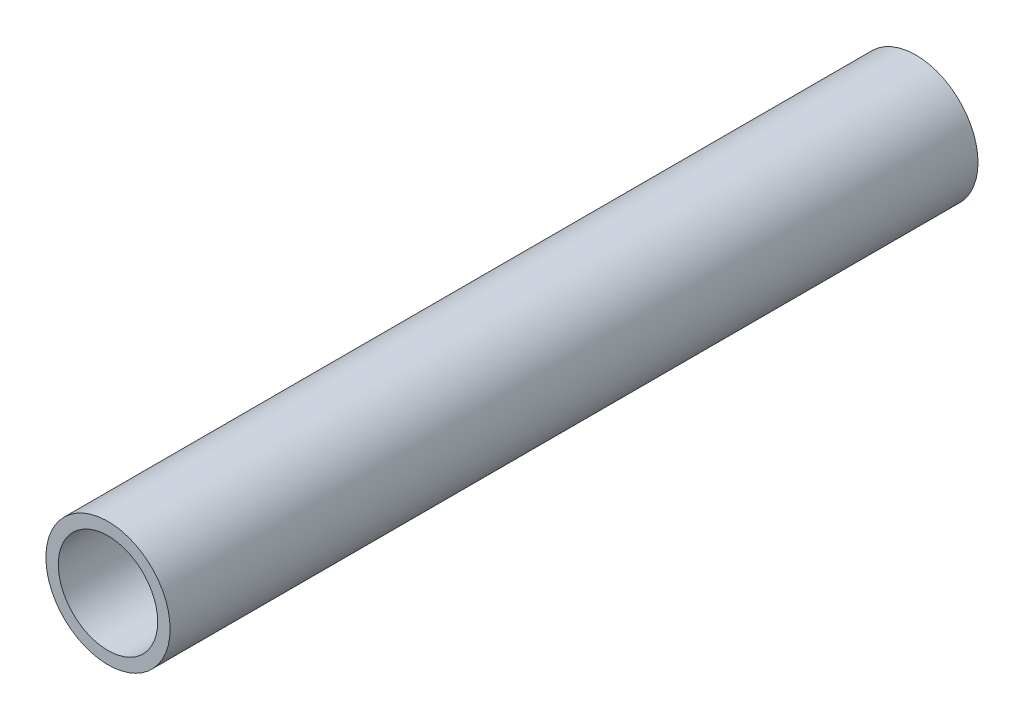
ISO-10303-21;
HEADER;
FILE_DESCRIPTION(('STEP AP214'),'2;1');
FILE_NAME('part.step','',(''),(''),'','','');
FILE_SCHEMA(('AUTOMOTIVE_DESIGN { 1 0 10303 214 1 1 1 1 }'));
ENDSEC;
DATA;
#1=APPLICATION_CONTEXT('core data for automotive mechanical design processes');
#2=APPLICATION_PROTOCOL_DEFINITION('international standard','automotive_design',2000,#1);
#3=PRODUCT_CONTEXT('',#1,'mechanical');
#4=PRODUCT('Part','Part','',(#3));
#5=PRODUCT_RELATED_PRODUCT_CATEGORY('part','',(#4));
#6=PRODUCT_DEFINITION_FORMATION('','',#4);
#7=PRODUCT_DEFINITION_CONTEXT('part definition',#1,'design');
#8=PRODUCT_DEFINITION('design','',#6,#7);
#9=PRODUCT_DEFINITION_SHAPE('','',#8);
#10=(LENGTH_UNIT() NAMED_UNIT(*) SI_UNIT(.MILLI.,.METRE.));
#11=(NAMED_UNIT(*) PLANE_ANGLE_UNIT() SI_UNIT($,.RADIAN.));
#12=(NAMED_UNIT(*) SI_UNIT($,.STERADIAN.) SOLID_ANGLE_UNIT());
#13=UNCERTAINTY_MEASURE_WITH_UNIT(LENGTH_MEASURE(1.E-05),#10,'distance_accuracy_value','');
#14=(GEOMETRIC_REPRESENTATION_CONTEXT(3) GLOBAL_UNCERTAINTY_ASSIGNED_CONTEXT((#13)) GLOBAL_UNIT_ASSIGNED_CONTEXT((#10,
#11,#12)) REPRESENTATION_CONTEXT('',''));
#15=CARTESIAN_POINT('',(0.,0.,0.));
#16=DIRECTION('',(0.,0.,1.));
#17=DIRECTION('',(1.,0.,0.));
#18=AXIS2_PLACEMENT_3D('',#15,#16,#17);
#19=CARTESIAN_POINT('',(0.,0.,16.2600000000011));
#20=DIRECTION('',(0.,0.,1.));
#21=DIRECTION('',(1.,0.,0.));
#22=AXIS2_PLACEMENT_3D('',#19,#20,#21);
#23=PLANE('',#22);
#24=CARTESIAN_POINT('',(0.,0.,16.2600000000011));
#25=DIRECTION('',(0.,0.,1.));
#26=DIRECTION('',(1.,0.,0.));
#27=AXIS2_PLACEMENT_3D('',#24,#25,#26);
#28=CIRCLE('',#27,1.25);
#29=CARTESIAN_POINT('',(1.25,0.,16.2600000000011));
#30=VERTEX_POINT('',#29);
#31=EDGE_CURVE('E10',#30,#30,#28,.T.);
#32=ORIENTED_EDGE('',*,*,#31,.T.);
#33=EDGE_LOOP('',(#32));
#34=FACE_BOUND('',#33,.T.);
#35=CARTESIAN_POINT('',(0.,0.,16.2600000000011));
#36=DIRECTION('',(0.,0.,1.));
#37=DIRECTION('',(1.,0.,0.));
#38=AXIS2_PLACEMENT_3D('',#35,#36,#37);
#39=CIRCLE('',#38,1.);
#40=CARTESIAN_POINT('',(1.,0.,16.2600000000011));
#41=VERTEX_POINT('',#40);
#42=EDGE_CURVE('E41',#41,#41,#39,.T.);
#43=ORIENTED_EDGE('',*,*,#42,.F.);
#44=EDGE_LOOP('',(#43));
#45=FACE_BOUND('',#44,.T.);
#46=ADVANCED_FACE('F30',(#34,#45),#23,.T.);
#47=CARTESIAN_POINT('',(0.,0.,0.));
#48=DIRECTION('',(0.,0.,1.));
#49=DIRECTION('',(1.,0.,0.));
#50=AXIS2_PLACEMENT_3D('',#47,#48,#49);
#51=PLANE('',#50);
#52=CARTESIAN_POINT('',(0.,0.,0.));
#53=DIRECTION('',(0.,0.,1.));
#54=DIRECTION('',(1.,0.,0.));
#55=AXIS2_PLACEMENT_3D('',#52,#53,#54);
#56=CIRCLE('',#55,1.25);
#57=CARTESIAN_POINT('',(1.25,0.,0.));
#58=VERTEX_POINT('',#57);
#59=EDGE_CURVE('E34',#58,#58,#56,.T.);
#60=ORIENTED_EDGE('',*,*,#59,.F.);
#61=EDGE_LOOP('',(#60));
#62=FACE_BOUND('',#61,.T.);
#63=CARTESIAN_POINT('',(0.,0.,0.));
#64=DIRECTION('',(0.,0.,1.));
#65=DIRECTION('',(1.,0.,0.));
#66=AXIS2_PLACEMENT_3D('',#63,#64,#65);
#67=CIRCLE('',#66,1.);
#68=CARTESIAN_POINT('',(1.,0.,0.));
#69=VERTEX_POINT('',#68);
#70=EDGE_CURVE('E43',#69,#69,#67,.T.);
#71=ORIENTED_EDGE('',*,*,#70,.T.);
#72=EDGE_LOOP('',(#71));
#73=FACE_BOUND('',#72,.T.);
#74=ADVANCED_FACE('F53',(#62,#73),#51,.F.);
#75=CARTESIAN_POINT('',(0.,0.,16.2600000000011));
#76=DIRECTION('',(0.,0.,-1.));
#77=DIRECTION('',(-1.,0.,0.));
#78=AXIS2_PLACEMENT_3D('',#75,#76,#77);
#79=CYLINDRICAL_SURFACE('',#78,1.25);
#80=ORIENTED_EDGE('',*,*,#31,.F.);
#81=EDGE_LOOP('',(#80));
#82=FACE_BOUND('',#81,.T.);
#83=ORIENTED_EDGE('',*,*,#59,.T.);
#84=EDGE_LOOP('',(#83));
#85=FACE_BOUND('',#84,.T.);
#86=ADVANCED_FACE('F32',(#82,#85),#79,.T.);
#87=CARTESIAN_POINT('',(0.,0.,16.2600000000011));
#88=DIRECTION('',(0.,0.,-1.));
#89=DIRECTION('',(-1.,0.,0.));
#90=AXIS2_PLACEMENT_3D('',#87,#88,#89);
#91=CYLINDRICAL_SURFACE('',#90,1.);
#92=ORIENTED_EDGE('',*,*,#42,.T.);
#93=EDGE_LOOP('',(#92));
#94=FACE_BOUND('',#93,.T.);
#95=ORIENTED_EDGE('',*,*,#70,.F.);
#96=EDGE_LOOP('',(#95));
#97=FACE_BOUND('',#96,.T.);
#98=ADVANCED_FACE('F49',(#94,#97),#91,.F.);
#99=CLOSED_SHELL('',(#46,#74,#86,#98));
#100=MANIFOLD_SOLID_BREP('B2',#99);
#101=ADVANCED_BREP_SHAPE_REPRESENTATION('',(#18,#100),#14);
#102=SHAPE_DEFINITION_REPRESENTATION(#9,#101);
ENDSEC;
END-ISO-10303-21;
